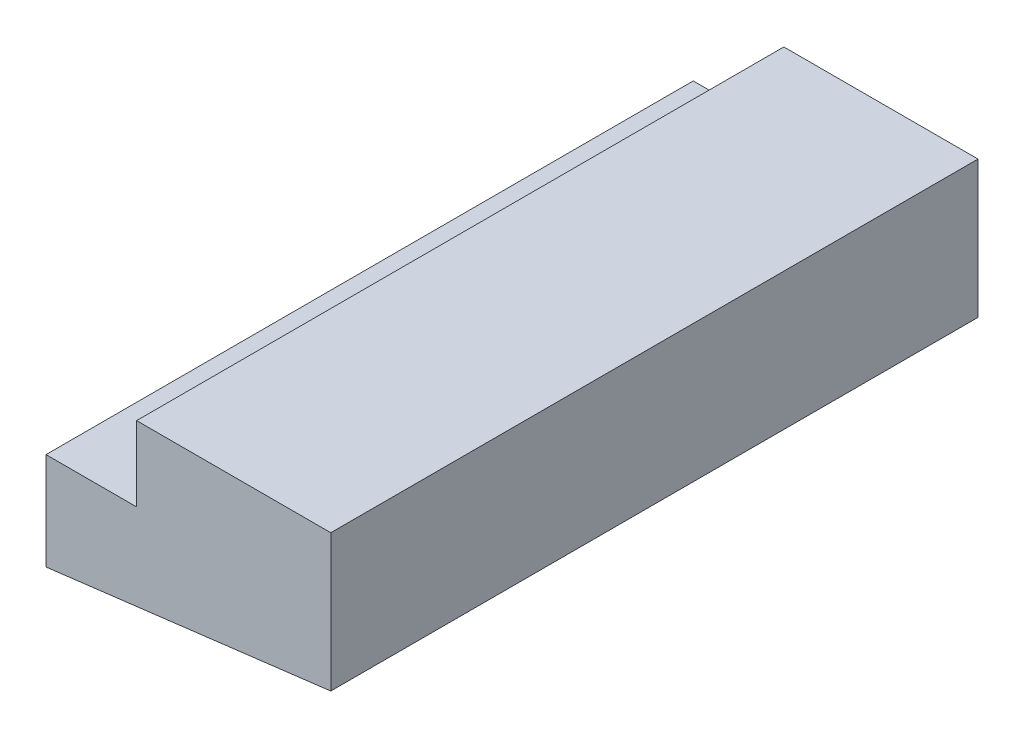
ISO-10303-21;
HEADER;
FILE_DESCRIPTION(('STEP AP214'),'2;1');
FILE_NAME('part.step','',(''),(''),'','','');
FILE_SCHEMA(('AUTOMOTIVE_DESIGN { 1 0 10303 214 1 1 1 1 }'));
ENDSEC;
DATA;
#1=APPLICATION_CONTEXT('core data for automotive mechanical design processes');
#2=APPLICATION_PROTOCOL_DEFINITION('international standard','automotive_design',2000,#1);
#3=PRODUCT_CONTEXT('',#1,'mechanical');
#4=PRODUCT('Part','Part','',(#3));
#5=PRODUCT_RELATED_PRODUCT_CATEGORY('part','',(#4));
#6=PRODUCT_DEFINITION_FORMATION('','',#4);
#7=PRODUCT_DEFINITION_CONTEXT('part definition',#1,'design');
#8=PRODUCT_DEFINITION('design','',#6,#7);
#9=PRODUCT_DEFINITION_SHAPE('','',#8);
#10=(LENGTH_UNIT() NAMED_UNIT(*) SI_UNIT(.MILLI.,.METRE.));
#11=(NAMED_UNIT(*) PLANE_ANGLE_UNIT() SI_UNIT($,.RADIAN.));
#12=(NAMED_UNIT(*) SI_UNIT($,.STERADIAN.) SOLID_ANGLE_UNIT());
#13=UNCERTAINTY_MEASURE_WITH_UNIT(LENGTH_MEASURE(1.E-05),#10,'distance_accuracy_value','');
#14=(GEOMETRIC_REPRESENTATION_CONTEXT(3) GLOBAL_UNCERTAINTY_ASSIGNED_CONTEXT((#13)) GLOBAL_UNIT_ASSIGNED_CONTEXT((#10,
#11,#12)) REPRESENTATION_CONTEXT('',''));
#15=CARTESIAN_POINT('',(0.,0.,0.));
#16=DIRECTION('',(0.,0.,1.));
#17=DIRECTION('',(1.,0.,0.));
#18=AXIS2_PLACEMENT_3D('',#15,#16,#17);
#19=CARTESIAN_POINT('',(180.,-52.9683930600497,250.));
#20=DIRECTION('',(-0.121869343405148,0.992546151641322,0.));
#21=DIRECTION('',(-0.992546151641322,-0.121869343405148,0.));
#22=AXIS2_PLACEMENT_3D('',#19,#20,#21);
#23=PLANE('',#22);
#24=DIRECTION('',(0.992546151641322,0.121869343405148,0.));
#25=VECTOR('',#24,1.);
#26=CARTESIAN_POINT('',(180.,-52.9683930600497,0.));
#27=LINE('',#26,#25);
#28=CARTESIAN_POINT('',(70.,-66.4746947593693,0.));
#29=VERTEX_POINT('',#28);
#30=CARTESIAN_POINT('',(180.,-52.9683930600497,0.));
#31=VERTEX_POINT('',#30);
#32=EDGE_CURVE('E117',#29,#31,#27,.T.);
#33=ORIENTED_EDGE('',*,*,#32,.T.);
#34=DIRECTION('',(0.,0.,-1.));
#35=VECTOR('',#34,1.);
#36=CARTESIAN_POINT('',(180.,-52.9683930600497,250.));
#37=LINE('',#36,#35);
#38=CARTESIAN_POINT('',(180.,-52.9683930600497,250.));
#39=VERTEX_POINT('',#38);
#40=EDGE_CURVE('E11',#39,#31,#37,.T.);
#41=ORIENTED_EDGE('',*,*,#40,.F.);
#42=DIRECTION('',(0.992546151641322,0.121869343405148,0.));
#43=VECTOR('',#42,1.);
#44=CARTESIAN_POINT('',(180.,-52.9683930600497,250.));
#45=LINE('',#44,#43);
#46=CARTESIAN_POINT('',(70.,-66.4746947593693,250.));
#47=VERTEX_POINT('',#46);
#48=EDGE_CURVE('E127',#47,#39,#45,.T.);
#49=ORIENTED_EDGE('',*,*,#48,.F.);
#50=DIRECTION('',(0.,0.,-1.));
#51=VECTOR('',#50,1.);
#52=CARTESIAN_POINT('',(70.,-66.4746947593693,250.));
#53=LINE('',#52,#51);
#54=EDGE_CURVE('E113',#47,#29,#53,.T.);
#55=ORIENTED_EDGE('',*,*,#54,.T.);
#56=EDGE_LOOP('',(#33,#41,#49,#55));
#57=FACE_BOUND('',#56,.T.);
#58=ADVANCED_FACE('F33',(#57),#23,.F.);
#59=CARTESIAN_POINT('',(180.,0.,250.));
#60=DIRECTION('',(-1.,0.,0.));
#61=DIRECTION('',(0.,0.,1.));
#62=AXIS2_PLACEMENT_3D('',#59,#60,#61);
#63=PLANE('',#62);
#64=DIRECTION('',(0.,1.,0.));
#65=VECTOR('',#64,1.);
#66=CARTESIAN_POINT('',(180.,0.,0.));
#67=LINE('',#66,#65);
#68=CARTESIAN_POINT('',(180.,0.,0.));
#69=VERTEX_POINT('',#68);
#70=EDGE_CURVE('E120',#31,#69,#67,.T.);
#71=ORIENTED_EDGE('',*,*,#70,.T.);
#72=DIRECTION('',(0.,0.,-1.));
#73=VECTOR('',#72,1.);
#74=CARTESIAN_POINT('',(180.,0.,250.));
#75=LINE('',#74,#73);
#76=CARTESIAN_POINT('',(180.,0.,250.));
#77=VERTEX_POINT('',#76);
#78=EDGE_CURVE('E41',#77,#69,#75,.T.);
#79=ORIENTED_EDGE('',*,*,#78,.F.);
#80=DIRECTION('',(0.,1.,0.));
#81=VECTOR('',#80,1.);
#82=CARTESIAN_POINT('',(180.,0.,250.));
#83=LINE('',#82,#81);
#84=EDGE_CURVE('E86',#39,#77,#83,.T.);
#85=ORIENTED_EDGE('',*,*,#84,.F.);
#86=ORIENTED_EDGE('',*,*,#40,.T.);
#87=EDGE_LOOP('',(#71,#79,#85,#86));
#88=FACE_BOUND('',#87,.T.);
#89=ADVANCED_FACE('F151',(#88),#63,.F.);
#90=CARTESIAN_POINT('',(105.,0.,250.));
#91=DIRECTION('',(0.,-1.,0.));
#92=DIRECTION('',(1.,0.,0.));
#93=AXIS2_PLACEMENT_3D('',#90,#91,#92);
#94=PLANE('',#93);
#95=DIRECTION('',(-1.,0.,0.));
#96=VECTOR('',#95,1.);
#97=CARTESIAN_POINT('',(105.,0.,0.));
#98=LINE('',#97,#96);
#99=CARTESIAN_POINT('',(105.,0.,0.));
#100=VERTEX_POINT('',#99);
#101=EDGE_CURVE('E122',#69,#100,#98,.T.);
#102=ORIENTED_EDGE('',*,*,#101,.T.);
#103=DIRECTION('',(0.,0.,-1.));
#104=VECTOR('',#103,1.);
#105=CARTESIAN_POINT('',(105.,0.,250.));
#106=LINE('',#105,#104);
#107=CARTESIAN_POINT('',(105.,0.,250.));
#108=VERTEX_POINT('',#107);
#109=EDGE_CURVE('E108',#108,#100,#106,.T.);
#110=ORIENTED_EDGE('',*,*,#109,.F.);
#111=DIRECTION('',(-1.,0.,0.));
#112=VECTOR('',#111,1.);
#113=CARTESIAN_POINT('',(105.,0.,250.));
#114=LINE('',#113,#112);
#115=EDGE_CURVE('E99',#77,#108,#114,.T.);
#116=ORIENTED_EDGE('',*,*,#115,.F.);
#117=ORIENTED_EDGE('',*,*,#78,.T.);
#118=EDGE_LOOP('',(#102,#110,#116,#117));
#119=FACE_BOUND('',#118,.T.);
#120=ADVANCED_FACE('F133',(#119),#94,.F.);
#121=CARTESIAN_POINT('',(105.,0.,250.));
#122=DIRECTION('',(1.,0.,0.));
#123=DIRECTION('',(0.,0.,-1.));
#124=AXIS2_PLACEMENT_3D('',#121,#122,#123);
#125=PLANE('',#124);
#126=DIRECTION('',(0.,-1.,0.));
#127=VECTOR('',#126,1.);
#128=CARTESIAN_POINT('',(105.,0.,0.));
#129=LINE('',#128,#127);
#130=CARTESIAN_POINT('',(105.,-28.8725713191737,0.));
#131=VERTEX_POINT('',#130);
#132=EDGE_CURVE('E107',#100,#131,#129,.T.);
#133=ORIENTED_EDGE('',*,*,#132,.T.);
#134=DIRECTION('',(0.,0.,-1.));
#135=VECTOR('',#134,1.);
#136=CARTESIAN_POINT('',(105.,-28.8725713191737,250.));
#137=LINE('',#136,#135);
#138=CARTESIAN_POINT('',(105.,-28.8725713191737,250.));
#139=VERTEX_POINT('',#138);
#140=EDGE_CURVE('E104',#139,#131,#137,.T.);
#141=ORIENTED_EDGE('',*,*,#140,.F.);
#142=DIRECTION('',(0.,-1.,0.));
#143=VECTOR('',#142,1.);
#144=CARTESIAN_POINT('',(105.,0.,250.));
#145=LINE('',#144,#143);
#146=EDGE_CURVE('E93',#108,#139,#145,.T.);
#147=ORIENTED_EDGE('',*,*,#146,.F.);
#148=ORIENTED_EDGE('',*,*,#109,.T.);
#149=EDGE_LOOP('',(#133,#141,#147,#148));
#150=FACE_BOUND('',#149,.T.);
#151=ADVANCED_FACE('F105',(#150),#125,.F.);
#152=CARTESIAN_POINT('',(105.,-28.8725713191737,250.));
#153=DIRECTION('',(0.,-1.,0.));
#154=DIRECTION('',(1.,0.,0.));
#155=AXIS2_PLACEMENT_3D('',#152,#153,#154);
#156=PLANE('',#155);
#157=DIRECTION('',(-1.,0.,0.));
#158=VECTOR('',#157,1.);
#159=CARTESIAN_POINT('',(105.,-28.8725713191737,0.));
#160=LINE('',#159,#158);
#161=CARTESIAN_POINT('',(70.,-28.8725713191737,0.));
#162=VERTEX_POINT('',#161);
#163=EDGE_CURVE('E72',#131,#162,#160,.T.);
#164=ORIENTED_EDGE('',*,*,#163,.T.);
#165=DIRECTION('',(0.,0.,-1.));
#166=VECTOR('',#165,1.);
#167=CARTESIAN_POINT('',(70.,-28.8725713191737,250.));
#168=LINE('',#167,#166);
#169=CARTESIAN_POINT('',(70.,-28.8725713191737,250.));
#170=VERTEX_POINT('',#169);
#171=EDGE_CURVE('E109',#170,#162,#168,.T.);
#172=ORIENTED_EDGE('',*,*,#171,.F.);
#173=DIRECTION('',(-1.,0.,0.));
#174=VECTOR('',#173,1.);
#175=CARTESIAN_POINT('',(105.,-28.8725713191737,250.));
#176=LINE('',#175,#174);
#177=EDGE_CURVE('E97',#139,#170,#176,.T.);
#178=ORIENTED_EDGE('',*,*,#177,.F.);
#179=ORIENTED_EDGE('',*,*,#140,.T.);
#180=EDGE_LOOP('',(#164,#172,#178,#179));
#181=FACE_BOUND('',#180,.T.);
#182=ADVANCED_FACE('F111',(#181),#156,.F.);
#183=CARTESIAN_POINT('',(70.,-28.8725713191737,250.));
#184=DIRECTION('',(1.,0.,0.));
#185=DIRECTION('',(0.,0.,-1.));
#186=AXIS2_PLACEMENT_3D('',#183,#184,#185);
#187=PLANE('',#186);
#188=DIRECTION('',(0.,-1.,0.));
#189=VECTOR('',#188,1.);
#190=CARTESIAN_POINT('',(70.,-28.8725713191737,0.));
#191=LINE('',#190,#189);
#192=EDGE_CURVE('E78',#162,#29,#191,.T.);
#193=ORIENTED_EDGE('',*,*,#192,.T.);
#194=ORIENTED_EDGE('',*,*,#54,.F.);
#195=DIRECTION('',(0.,-1.,0.));
#196=VECTOR('',#195,1.);
#197=CARTESIAN_POINT('',(70.,-28.8725713191737,250.));
#198=LINE('',#197,#196);
#199=EDGE_CURVE('E49',#170,#47,#198,.T.);
#200=ORIENTED_EDGE('',*,*,#199,.F.);
#201=ORIENTED_EDGE('',*,*,#171,.T.);
#202=EDGE_LOOP('',(#193,#194,#200,#201));
#203=FACE_BOUND('',#202,.T.);
#204=ADVANCED_FACE('F140',(#203),#187,.F.);
#205=CARTESIAN_POINT('',(0.,0.,250.));
#206=DIRECTION('',(0.,0.,1.));
#207=DIRECTION('',(1.,0.,0.));
#208=AXIS2_PLACEMENT_3D('',#205,#206,#207);
#209=PLANE('',#208);
#210=ORIENTED_EDGE('',*,*,#48,.T.);
#211=ORIENTED_EDGE('',*,*,#84,.T.);
#212=ORIENTED_EDGE('',*,*,#115,.T.);
#213=ORIENTED_EDGE('',*,*,#146,.T.);
#214=ORIENTED_EDGE('',*,*,#177,.T.);
#215=ORIENTED_EDGE('',*,*,#199,.T.);
#216=EDGE_LOOP('',(#210,#211,#212,#213,#214,#215));
#217=FACE_BOUND('',#216,.T.);
#218=ADVANCED_FACE('F95',(#217),#209,.T.);
#219=CARTESIAN_POINT('',(0.,0.,0.));
#220=DIRECTION('',(0.,0.,1.));
#221=DIRECTION('',(1.,0.,0.));
#222=AXIS2_PLACEMENT_3D('',#219,#220,#221);
#223=PLANE('',#222);
#224=ORIENTED_EDGE('',*,*,#32,.F.);
#225=ORIENTED_EDGE('',*,*,#192,.F.);
#226=ORIENTED_EDGE('',*,*,#163,.F.);
#227=ORIENTED_EDGE('',*,*,#132,.F.);
#228=ORIENTED_EDGE('',*,*,#101,.F.);
#229=ORIENTED_EDGE('',*,*,#70,.F.);
#230=EDGE_LOOP('',(#224,#225,#226,#227,#228,#229));
#231=FACE_BOUND('',#230,.T.);
#232=ADVANCED_FACE('F136',(#231),#223,.F.);
#233=CLOSED_SHELL('',(#58,#89,#120,#151,#182,#204,#218,#232));
#234=MANIFOLD_SOLID_BREP('B2',#233);
#235=ADVANCED_BREP_SHAPE_REPRESENTATION('',(#18,#234),#14);
#236=SHAPE_DEFINITION_REPRESENTATION(#9,#235);
ENDSEC;
END-ISO-10303-21;
